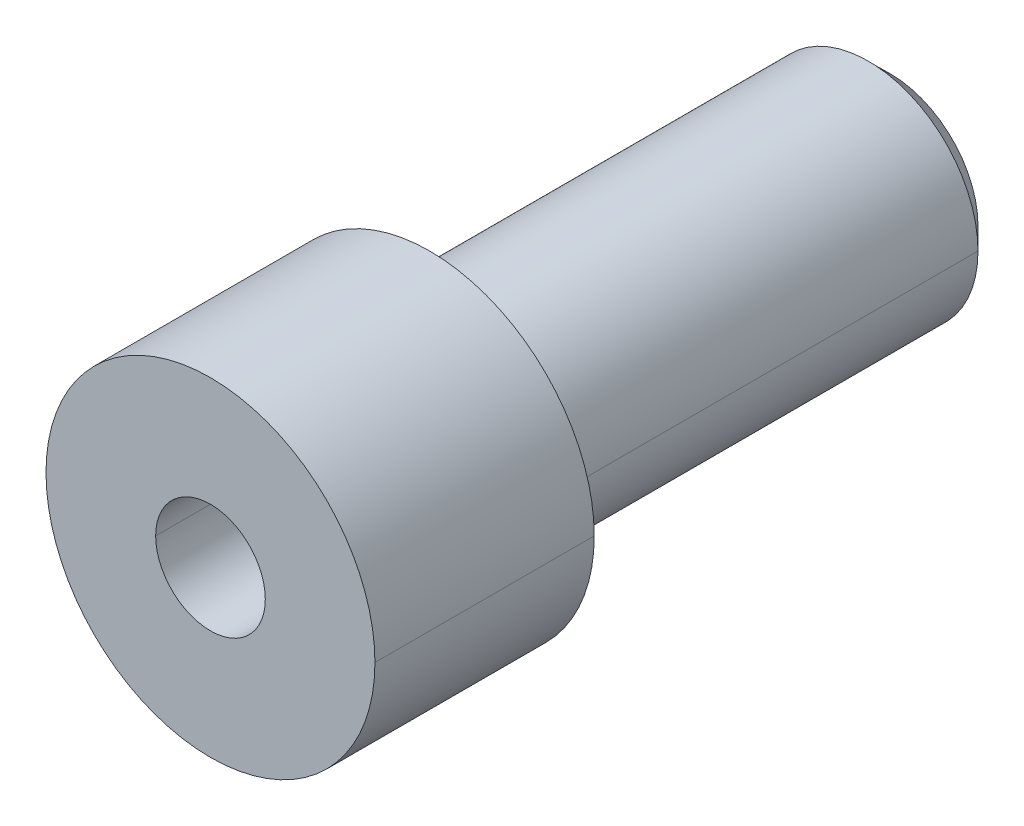
ISO-10303-21;
HEADER;
FILE_DESCRIPTION(('STEP AP214'),'2;1');
FILE_NAME('part.step','',(''),(''),'','','');
FILE_SCHEMA(('AUTOMOTIVE_DESIGN { 1 0 10303 214 1 1 1 1 }'));
ENDSEC;
DATA;
#1=APPLICATION_CONTEXT('core data for automotive mechanical design processes');
#2=APPLICATION_PROTOCOL_DEFINITION('international standard','automotive_design',2000,#1);
#3=PRODUCT_CONTEXT('',#1,'mechanical');
#4=PRODUCT('Part','Part','',(#3));
#5=PRODUCT_RELATED_PRODUCT_CATEGORY('part','',(#4));
#6=PRODUCT_DEFINITION_FORMATION('','',#4);
#7=PRODUCT_DEFINITION_CONTEXT('part definition',#1,'design');
#8=PRODUCT_DEFINITION('design','',#6,#7);
#9=PRODUCT_DEFINITION_SHAPE('','',#8);
#10=(LENGTH_UNIT() NAMED_UNIT(*) SI_UNIT(.MILLI.,.METRE.));
#11=(NAMED_UNIT(*) PLANE_ANGLE_UNIT() SI_UNIT($,.RADIAN.));
#12=(NAMED_UNIT(*) SI_UNIT($,.STERADIAN.) SOLID_ANGLE_UNIT());
#13=UNCERTAINTY_MEASURE_WITH_UNIT(LENGTH_MEASURE(1.E-05),#10,'distance_accuracy_value','');
#14=(GEOMETRIC_REPRESENTATION_CONTEXT(3) GLOBAL_UNCERTAINTY_ASSIGNED_CONTEXT((#13)) GLOBAL_UNIT_ASSIGNED_CONTEXT((#10,
#11,#12)) REPRESENTATION_CONTEXT('',''));
#15=CARTESIAN_POINT('',(0.,0.,0.));
#16=DIRECTION('',(0.,0.,1.));
#17=DIRECTION('',(1.,0.,0.));
#18=AXIS2_PLACEMENT_3D('',#15,#16,#17);
#19=CARTESIAN_POINT('',(0.,0.,2.));
#20=DIRECTION('',(0.,0.,1.));
#21=DIRECTION('',(1.,0.,0.));
#22=AXIS2_PLACEMENT_3D('',#19,#20,#21);
#23=CYLINDRICAL_SURFACE('',#22,0.5);
#24=DIRECTION('',(0.,0.,1.));
#25=VECTOR('',#24,1.);
#26=CARTESIAN_POINT('',(-0.5,0.,2.));
#27=LINE('',#26,#25);
#28=CARTESIAN_POINT('',(-0.5,0.,-3.2));
#29=VERTEX_POINT('',#28);
#30=CARTESIAN_POINT('',(-0.5,0.,2.));
#31=VERTEX_POINT('',#30);
#32=EDGE_CURVE('E142',#29,#31,#27,.T.);
#33=ORIENTED_EDGE('',*,*,#32,.F.);
#34=CARTESIAN_POINT('',(0.,0.,-3.2));
#35=DIRECTION('',(0.,0.,1.));
#36=DIRECTION('',(1.,0.,0.));
#37=AXIS2_PLACEMENT_3D('',#34,#35,#36);
#38=CIRCLE('',#37,0.5);
#39=CARTESIAN_POINT('',(0.5,0.,-3.2));
#40=VERTEX_POINT('',#39);
#41=EDGE_CURVE('E11',#40,#29,#38,.T.);
#42=ORIENTED_EDGE('',*,*,#41,.F.);
#43=DIRECTION('',(0.,0.,1.));
#44=VECTOR('',#43,1.);
#45=CARTESIAN_POINT('',(0.5,0.,2.));
#46=LINE('',#45,#44);
#47=CARTESIAN_POINT('',(0.5,0.,2.));
#48=VERTEX_POINT('',#47);
#49=EDGE_CURVE('E153',#40,#48,#46,.T.);
#50=ORIENTED_EDGE('',*,*,#49,.T.);
#51=CARTESIAN_POINT('',(0.,0.,2.));
#52=DIRECTION('',(0.,0.,1.));
#53=DIRECTION('',(1.,0.,0.));
#54=AXIS2_PLACEMENT_3D('',#51,#52,#53);
#55=CIRCLE('',#54,0.5);
#56=EDGE_CURVE('E180',#48,#31,#55,.T.);
#57=ORIENTED_EDGE('',*,*,#56,.T.);
#58=EDGE_LOOP('',(#33,#42,#50,#57));
#59=FACE_BOUND('',#58,.T.);
#60=ADVANCED_FACE('F17',(#59),#23,.F.);
#61=CARTESIAN_POINT('',(0.,0.,-3.2));
#62=DIRECTION('',(0.,0.,1.));
#63=DIRECTION('',(1.,0.,0.));
#64=AXIS2_PLACEMENT_3D('',#61,#62,#63);
#65=CONICAL_SURFACE('',#64,0.5,1.029744258677);
#66=DIRECTION('',(-0.857167300702106,0.,0.515038074910064));
#67=VECTOR('',#66,1.);
#68=CARTESIAN_POINT('',(-0.5,0.,-3.2));
#69=LINE('',#68,#67);
#70=CARTESIAN_POINT('',(0.,0.,-3.500430309514));
#71=VERTEX_POINT('',#70);
#72=EDGE_CURVE('E165',#71,#29,#69,.T.);
#73=ORIENTED_EDGE('',*,*,#72,.F.);
#74=DIRECTION('',(0.857167300702106,0.,0.515038074910064));
#75=VECTOR('',#74,1.);
#76=CARTESIAN_POINT('',(0.5,0.,-3.2));
#77=LINE('',#76,#75);
#78=EDGE_CURVE('E157',#71,#40,#77,.T.);
#79=ORIENTED_EDGE('',*,*,#78,.T.);
#80=ORIENTED_EDGE('',*,*,#41,.T.);
#81=EDGE_LOOP('',(#73,#79,#80));
#82=FACE_BOUND('',#81,.T.);
#83=ADVANCED_FACE('F319',(#82),#65,.F.);
#84=CARTESIAN_POINT('',(0.,0.,-4.2));
#85=DIRECTION('',(0.,0.,1.));
#86=DIRECTION('',(1.,0.,0.));
#87=AXIS2_PLACEMENT_3D('',#84,#85,#86);
#88=CONICAL_SURFACE('',#87,0.8,0.785398163397);
#89=DIRECTION('',(-0.707106781186548,0.,0.707106781186548));
#90=VECTOR('',#89,1.);
#91=CARTESIAN_POINT('',(-0.8,0.,-4.2));
#92=LINE('',#91,#90);
#93=CARTESIAN_POINT('',(-0.8,0.,-4.2));
#94=VERTEX_POINT('',#93);
#95=CARTESIAN_POINT('',(-1.,0.,-4.));
#96=VERTEX_POINT('',#95);
#97=EDGE_CURVE('E130',#94,#96,#92,.T.);
#98=ORIENTED_EDGE('',*,*,#97,.F.);
#99=CARTESIAN_POINT('',(0.,0.,-4.2));
#100=DIRECTION('',(0.,0.,-1.));
#101=DIRECTION('',(-1.,0.,0.));
#102=AXIS2_PLACEMENT_3D('',#99,#100,#101);
#103=CIRCLE('',#102,0.8);
#104=CARTESIAN_POINT('',(0.8,0.,-4.2));
#105=VERTEX_POINT('',#104);
#106=EDGE_CURVE('E28',#105,#94,#103,.T.);
#107=ORIENTED_EDGE('',*,*,#106,.F.);
#108=DIRECTION('',(0.707106781186548,0.,0.707106781186548));
#109=VECTOR('',#108,1.);
#110=CARTESIAN_POINT('',(0.8,0.,-4.2));
#111=LINE('',#110,#109);
#112=CARTESIAN_POINT('',(1.,0.,-4.));
#113=VERTEX_POINT('',#112);
#114=EDGE_CURVE('E122',#105,#113,#111,.T.);
#115=ORIENTED_EDGE('',*,*,#114,.T.);
#116=CARTESIAN_POINT('',(0.,0.,-4.));
#117=DIRECTION('',(0.,0.,1.));
#118=DIRECTION('',(-1.,0.,0.));
#119=AXIS2_PLACEMENT_3D('',#116,#117,#118);
#120=CIRCLE('',#119,1.);
#121=EDGE_CURVE('E96',#96,#113,#120,.T.);
#122=ORIENTED_EDGE('',*,*,#121,.F.);
#123=EDGE_LOOP('',(#98,#107,#115,#122));
#124=FACE_BOUND('',#123,.T.);
#125=ADVANCED_FACE('F123',(#124),#88,.T.);
#126=CARTESIAN_POINT('',(0.,0.,-4.2));
#127=DIRECTION('',(0.,0.,-1.));
#128=DIRECTION('',(0.,-1.,0.));
#129=AXIS2_PLACEMENT_3D('',#126,#127,#128);
#130=PLANE('',#129);
#131=ORIENTED_EDGE('',*,*,#106,.T.);
#132=CARTESIAN_POINT('',(0.,0.,-4.2));
#133=DIRECTION('',(0.,0.,-1.));
#134=DIRECTION('',(-1.,0.,0.));
#135=AXIS2_PLACEMENT_3D('',#132,#133,#134);
#136=CIRCLE('',#135,0.8);
#137=EDGE_CURVE('E138',#94,#105,#136,.T.);
#138=ORIENTED_EDGE('',*,*,#137,.T.);
#139=EDGE_LOOP('',(#131,#138));
#140=FACE_BOUND('',#139,.T.);
#141=ADVANCED_FACE('F19',(#140),#130,.T.);
#142=CARTESIAN_POINT('',(0.,0.,-4.2));
#143=DIRECTION('',(0.,0.,1.));
#144=DIRECTION('',(1.,0.,0.));
#145=AXIS2_PLACEMENT_3D('',#142,#143,#144);
#146=CYLINDRICAL_SURFACE('',#145,1.);
#147=DIRECTION('',(0.,0.,1.));
#148=VECTOR('',#147,1.);
#149=CARTESIAN_POINT('',(-1.,0.,-4.2));
#150=LINE('',#149,#148);
#151=CARTESIAN_POINT('',(-1.,0.,0.));
#152=VERTEX_POINT('',#151);
#153=EDGE_CURVE('E107',#96,#152,#150,.T.);
#154=ORIENTED_EDGE('',*,*,#153,.F.);
#155=ORIENTED_EDGE('',*,*,#121,.T.);
#156=DIRECTION('',(0.,0.,1.));
#157=VECTOR('',#156,1.);
#158=CARTESIAN_POINT('',(1.,0.,-4.2));
#159=LINE('',#158,#157);
#160=CARTESIAN_POINT('',(1.,0.,0.));
#161=VERTEX_POINT('',#160);
#162=EDGE_CURVE('E104',#113,#161,#159,.T.);
#163=ORIENTED_EDGE('',*,*,#162,.T.);
#164=CARTESIAN_POINT('',(0.,0.,0.));
#165=DIRECTION('',(0.,0.,-1.));
#166=DIRECTION('',(-1.,0.,0.));
#167=AXIS2_PLACEMENT_3D('',#164,#165,#166);
#168=CIRCLE('',#167,1.);
#169=EDGE_CURVE('E21',#161,#152,#168,.T.);
#170=ORIENTED_EDGE('',*,*,#169,.T.);
#171=EDGE_LOOP('',(#154,#155,#163,#170));
#172=FACE_BOUND('',#171,.T.);
#173=ADVANCED_FACE('F103',(#172),#146,.T.);
#174=CARTESIAN_POINT('',(0.,0.,0.));
#175=DIRECTION('',(0.,0.,1.));
#176=DIRECTION('',(1.,0.,0.));
#177=AXIS2_PLACEMENT_3D('',#174,#175,#176);
#178=PLANE('',#177);
#179=CARTESIAN_POINT('',(0.,0.,0.));
#180=DIRECTION('',(0.,0.,1.));
#181=DIRECTION('',(1.,0.,0.));
#182=AXIS2_PLACEMENT_3D('',#179,#180,#181);
#183=CIRCLE('',#182,1.5);
#184=CARTESIAN_POINT('',(-1.5,0.,0.));
#185=VERTEX_POINT('',#184);
#186=CARTESIAN_POINT('',(1.5,0.,0.));
#187=VERTEX_POINT('',#186);
#188=EDGE_CURVE('E40',#185,#187,#183,.T.);
#189=ORIENTED_EDGE('',*,*,#188,.F.);
#190=CARTESIAN_POINT('',(0.,0.,0.));
#191=DIRECTION('',(0.,0.,1.));
#192=DIRECTION('',(1.,0.,0.));
#193=AXIS2_PLACEMENT_3D('',#190,#191,#192);
#194=CIRCLE('',#193,1.5);
#195=EDGE_CURVE('E144',#187,#185,#194,.T.);
#196=ORIENTED_EDGE('',*,*,#195,.F.);
#197=EDGE_LOOP('',(#189,#196));
#198=FACE_BOUND('',#197,.T.);
#199=ORIENTED_EDGE('',*,*,#169,.F.);
#200=CARTESIAN_POINT('',(0.,0.,0.));
#201=DIRECTION('',(0.,0.,-1.));
#202=DIRECTION('',(-1.,0.,0.));
#203=AXIS2_PLACEMENT_3D('',#200,#201,#202);
#204=CIRCLE('',#203,1.);
#205=EDGE_CURVE('E117',#152,#161,#204,.T.);
#206=ORIENTED_EDGE('',*,*,#205,.F.);
#207=EDGE_LOOP('',(#199,#206));
#208=FACE_BOUND('',#207,.T.);
#209=ADVANCED_FACE('F203',(#198,#208),#178,.F.);
#210=CARTESIAN_POINT('',(0.,0.,2.));
#211=DIRECTION('',(0.,0.,1.));
#212=DIRECTION('',(1.,0.,0.));
#213=AXIS2_PLACEMENT_3D('',#210,#211,#212);
#214=PLANE('',#213);
#215=CARTESIAN_POINT('',(0.,0.,2.));
#216=DIRECTION('',(0.,0.,1.));
#217=DIRECTION('',(1.,0.,0.));
#218=AXIS2_PLACEMENT_3D('',#215,#216,#217);
#219=CIRCLE('',#218,1.5);
#220=CARTESIAN_POINT('',(-1.5,0.,2.));
#221=VERTEX_POINT('',#220);
#222=CARTESIAN_POINT('',(1.5,0.,2.));
#223=VERTEX_POINT('',#222);
#224=EDGE_CURVE('E150',#221,#223,#219,.T.);
#225=ORIENTED_EDGE('',*,*,#224,.T.);
#226=CARTESIAN_POINT('',(0.,0.,2.));
#227=DIRECTION('',(0.,0.,1.));
#228=DIRECTION('',(1.,0.,0.));
#229=AXIS2_PLACEMENT_3D('',#226,#227,#228);
#230=CIRCLE('',#229,1.5);
#231=EDGE_CURVE('E119',#223,#221,#230,.T.);
#232=ORIENTED_EDGE('',*,*,#231,.T.);
#233=EDGE_LOOP('',(#225,#232));
#234=FACE_BOUND('',#233,.T.);
#235=ORIENTED_EDGE('',*,*,#56,.F.);
#236=CARTESIAN_POINT('',(0.,0.,2.));
#237=DIRECTION('',(0.,0.,1.));
#238=DIRECTION('',(1.,0.,0.));
#239=AXIS2_PLACEMENT_3D('',#236,#237,#238);
#240=CIRCLE('',#239,0.5);
#241=EDGE_CURVE('E158',#31,#48,#240,.T.);
#242=ORIENTED_EDGE('',*,*,#241,.F.);
#243=EDGE_LOOP('',(#235,#242));
#244=FACE_BOUND('',#243,.T.);
#245=ADVANCED_FACE('F206',(#234,#244),#214,.T.);
#246=CARTESIAN_POINT('',(0.,0.,2.));
#247=DIRECTION('',(0.,0.,-1.));
#248=DIRECTION('',(-1.,0.,0.));
#249=AXIS2_PLACEMENT_3D('',#246,#247,#248);
#250=CYLINDRICAL_SURFACE('',#249,1.5);
#251=DIRECTION('',(0.,0.,-1.));
#252=VECTOR('',#251,1.);
#253=CARTESIAN_POINT('',(1.5,0.,2.));
#254=LINE('',#253,#252);
#255=EDGE_CURVE('E149',#223,#187,#254,.T.);
#256=ORIENTED_EDGE('',*,*,#255,.F.);
#257=ORIENTED_EDGE('',*,*,#224,.F.);
#258=DIRECTION('',(0.,0.,-1.));
#259=VECTOR('',#258,1.);
#260=CARTESIAN_POINT('',(-1.5,0.,2.));
#261=LINE('',#260,#259);
#262=EDGE_CURVE('E148',#221,#185,#261,.T.);
#263=ORIENTED_EDGE('',*,*,#262,.T.);
#264=ORIENTED_EDGE('',*,*,#188,.T.);
#265=EDGE_LOOP('',(#256,#257,#263,#264));
#266=FACE_BOUND('',#265,.T.);
#267=ADVANCED_FACE('F199',(#266),#250,.T.);
#268=CARTESIAN_POINT('',(0.,0.,2.));
#269=DIRECTION('',(0.,0.,-1.));
#270=DIRECTION('',(-1.,0.,0.));
#271=AXIS2_PLACEMENT_3D('',#268,#269,#270);
#272=CYLINDRICAL_SURFACE('',#271,1.5);
#273=ORIENTED_EDGE('',*,*,#231,.F.);
#274=ORIENTED_EDGE('',*,*,#255,.T.);
#275=ORIENTED_EDGE('',*,*,#195,.T.);
#276=ORIENTED_EDGE('',*,*,#262,.F.);
#277=EDGE_LOOP('',(#273,#274,#275,#276));
#278=FACE_BOUND('',#277,.T.);
#279=ADVANCED_FACE('F202',(#278),#272,.T.);
#280=CARTESIAN_POINT('',(0.,0.,-4.2));
#281=DIRECTION('',(0.,0.,1.));
#282=DIRECTION('',(1.,0.,0.));
#283=AXIS2_PLACEMENT_3D('',#280,#281,#282);
#284=CYLINDRICAL_SURFACE('',#283,1.);
#285=CARTESIAN_POINT('',(0.,0.,-4.));
#286=DIRECTION('',(0.,0.,1.));
#287=DIRECTION('',(-1.,0.,0.));
#288=AXIS2_PLACEMENT_3D('',#285,#286,#287);
#289=CIRCLE('',#288,1.);
#290=EDGE_CURVE('E114',#113,#96,#289,.T.);
#291=ORIENTED_EDGE('',*,*,#290,.T.);
#292=ORIENTED_EDGE('',*,*,#153,.T.);
#293=ORIENTED_EDGE('',*,*,#205,.T.);
#294=ORIENTED_EDGE('',*,*,#162,.F.);
#295=EDGE_LOOP('',(#291,#292,#293,#294));
#296=FACE_BOUND('',#295,.T.);
#297=ADVANCED_FACE('F112',(#296),#284,.T.);
#298=CARTESIAN_POINT('',(0.,0.,-4.2));
#299=DIRECTION('',(0.,0.,1.));
#300=DIRECTION('',(1.,0.,0.));
#301=AXIS2_PLACEMENT_3D('',#298,#299,#300);
#302=CONICAL_SURFACE('',#301,0.8,0.785398163397);
#303=ORIENTED_EDGE('',*,*,#137,.F.);
#304=ORIENTED_EDGE('',*,*,#97,.T.);
#305=ORIENTED_EDGE('',*,*,#290,.F.);
#306=ORIENTED_EDGE('',*,*,#114,.F.);
#307=EDGE_LOOP('',(#303,#304,#305,#306));
#308=FACE_BOUND('',#307,.T.);
#309=ADVANCED_FACE('F129',(#308),#302,.T.);
#310=CARTESIAN_POINT('',(0.,0.,-3.2));
#311=DIRECTION('',(0.,0.,1.));
#312=DIRECTION('',(1.,0.,0.));
#313=AXIS2_PLACEMENT_3D('',#310,#311,#312);
#314=CONICAL_SURFACE('',#313,0.5,1.029744258677);
#315=ORIENTED_EDGE('',*,*,#78,.F.);
#316=ORIENTED_EDGE('',*,*,#72,.T.);
#317=CARTESIAN_POINT('',(0.,0.,-3.2));
#318=DIRECTION('',(0.,0.,1.));
#319=DIRECTION('',(1.,0.,0.));
#320=AXIS2_PLACEMENT_3D('',#317,#318,#319);
#321=CIRCLE('',#320,0.5);
#322=EDGE_CURVE('E161',#29,#40,#321,.T.);
#323=ORIENTED_EDGE('',*,*,#322,.T.);
#324=EDGE_LOOP('',(#315,#316,#323));
#325=FACE_BOUND('',#324,.T.);
#326=ADVANCED_FACE('F313',(#325),#314,.F.);
#327=CARTESIAN_POINT('',(0.,0.,2.));
#328=DIRECTION('',(0.,0.,1.));
#329=DIRECTION('',(1.,0.,0.));
#330=AXIS2_PLACEMENT_3D('',#327,#328,#329);
#331=CYLINDRICAL_SURFACE('',#330,0.5);
#332=ORIENTED_EDGE('',*,*,#322,.F.);
#333=ORIENTED_EDGE('',*,*,#32,.T.);
#334=ORIENTED_EDGE('',*,*,#241,.T.);
#335=ORIENTED_EDGE('',*,*,#49,.F.);
#336=EDGE_LOOP('',(#332,#333,#334,#335));
#337=FACE_BOUND('',#336,.T.);
#338=ADVANCED_FACE('F309',(#337),#331,.F.);
#339=CLOSED_SHELL('',(#60,#83,#125,#141,#173,#209,#245,#267,#279,#297,#309,#326,#338));
#340=MANIFOLD_SOLID_BREP('B1',#339);
#341=ADVANCED_BREP_SHAPE_REPRESENTATION('',(#18,#340),#14);
#342=SHAPE_DEFINITION_REPRESENTATION(#9,#341);
ENDSEC;
END-ISO-10303-21;
